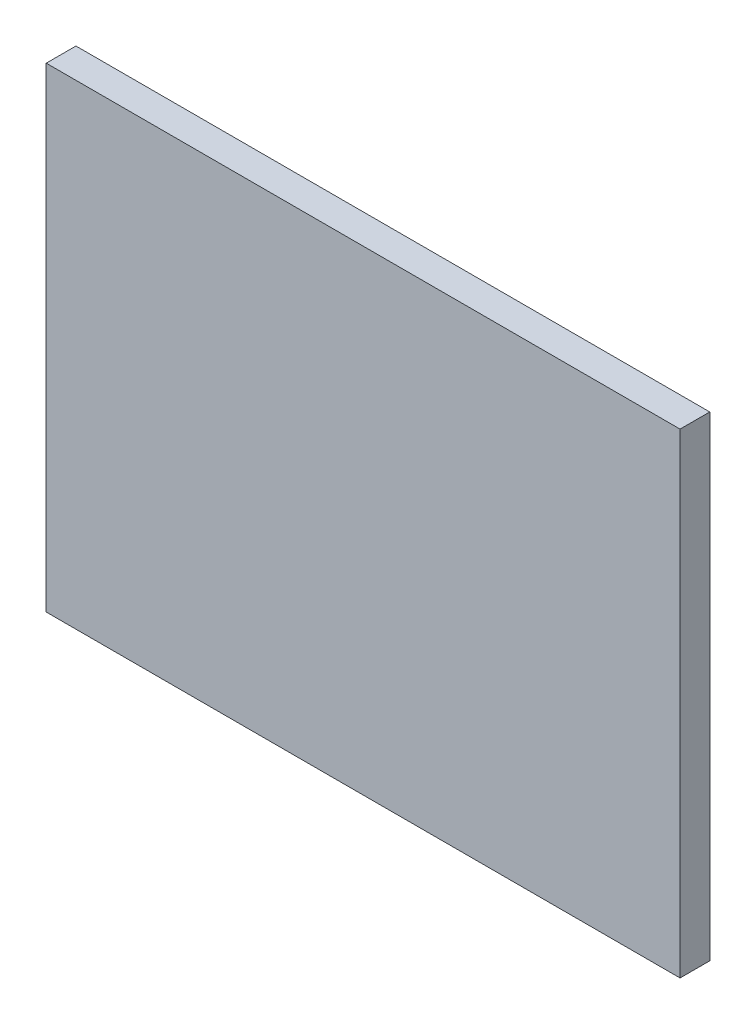
ISO-10303-21;
HEADER;
FILE_DESCRIPTION(('STEP AP214'),'2;1');
FILE_NAME('part.step','',(''),(''),'','','');
FILE_SCHEMA(('AUTOMOTIVE_DESIGN { 1 0 10303 214 1 1 1 1 }'));
ENDSEC;
DATA;
#1=APPLICATION_CONTEXT('core data for automotive mechanical design processes');
#2=APPLICATION_PROTOCOL_DEFINITION('international standard','automotive_design',2000,#1);
#3=PRODUCT_CONTEXT('',#1,'mechanical');
#4=PRODUCT('Part','Part','',(#3));
#5=PRODUCT_RELATED_PRODUCT_CATEGORY('part','',(#4));
#6=PRODUCT_DEFINITION_FORMATION('','',#4);
#7=PRODUCT_DEFINITION_CONTEXT('part definition',#1,'design');
#8=PRODUCT_DEFINITION('design','',#6,#7);
#9=PRODUCT_DEFINITION_SHAPE('','',#8);
#10=(LENGTH_UNIT() NAMED_UNIT(*) SI_UNIT(.MILLI.,.METRE.));
#11=(NAMED_UNIT(*) PLANE_ANGLE_UNIT() SI_UNIT($,.RADIAN.));
#12=(NAMED_UNIT(*) SI_UNIT($,.STERADIAN.) SOLID_ANGLE_UNIT());
#13=UNCERTAINTY_MEASURE_WITH_UNIT(LENGTH_MEASURE(1.E-05),#10,'distance_accuracy_value','');
#14=(GEOMETRIC_REPRESENTATION_CONTEXT(3) GLOBAL_UNCERTAINTY_ASSIGNED_CONTEXT((#13)) GLOBAL_UNIT_ASSIGNED_CONTEXT((#10,
#11,#12)) REPRESENTATION_CONTEXT('',''));
#15=CARTESIAN_POINT('',(0.,0.,0.));
#16=DIRECTION('',(0.,0.,1.));
#17=DIRECTION('',(1.,0.,0.));
#18=AXIS2_PLACEMENT_3D('',#15,#16,#17);
#19=CARTESIAN_POINT('',(-100.400410677618,-228.208829568789,19.05));
#20=DIRECTION('',(1.,0.,0.));
#21=DIRECTION('',(0.,0.,-1.));
#22=AXIS2_PLACEMENT_3D('',#19,#20,#21);
#23=PLANE('',#22);
#24=DIRECTION('',(0.,-1.,0.));
#25=VECTOR('',#24,1.);
#26=CARTESIAN_POINT('',(-100.400410677618,-228.208829568789,0.));
#27=LINE('',#26,#25);
#28=CARTESIAN_POINT('',(-100.400410677618,76.5911704312115,0.));
#29=VERTEX_POINT('',#28);
#30=CARTESIAN_POINT('',(-100.400410677618,-228.208829568789,0.));
#31=VERTEX_POINT('',#30);
#32=EDGE_CURVE('E96',#29,#31,#27,.T.);
#33=ORIENTED_EDGE('',*,*,#32,.T.);
#34=DIRECTION('',(0.,0.,-1.));
#35=VECTOR('',#34,1.);
#36=CARTESIAN_POINT('',(-100.400410677618,-228.208829568789,19.05));
#37=LINE('',#36,#35);
#38=CARTESIAN_POINT('',(-100.400410677618,-228.208829568789,19.05));
#39=VERTEX_POINT('',#38);
#40=EDGE_CURVE('E11',#39,#31,#37,.T.);
#41=ORIENTED_EDGE('',*,*,#40,.F.);
#42=DIRECTION('',(0.,-1.,0.));
#43=VECTOR('',#42,1.);
#44=CARTESIAN_POINT('',(-100.400410677618,-228.208829568789,19.05));
#45=LINE('',#44,#43);
#46=CARTESIAN_POINT('',(-100.400410677618,76.5911704312115,19.05));
#47=VERTEX_POINT('',#46);
#48=EDGE_CURVE('E84',#47,#39,#45,.T.);
#49=ORIENTED_EDGE('',*,*,#48,.F.);
#50=DIRECTION('',(0.,0.,-1.));
#51=VECTOR('',#50,1.);
#52=CARTESIAN_POINT('',(-100.400410677618,76.5911704312115,19.05));
#53=LINE('',#52,#51);
#54=EDGE_CURVE('E92',#47,#29,#53,.T.);
#55=ORIENTED_EDGE('',*,*,#54,.T.);
#56=EDGE_LOOP('',(#33,#41,#49,#55));
#57=FACE_BOUND('',#56,.T.);
#58=ADVANCED_FACE('F33',(#57),#23,.F.);
#59=CARTESIAN_POINT('',(-100.400410677618,-228.208829568789,19.05));
#60=DIRECTION('',(0.,1.,0.));
#61=DIRECTION('',(0.,0.,1.));
#62=AXIS2_PLACEMENT_3D('',#59,#60,#61);
#63=PLANE('',#62);
#64=DIRECTION('',(1.,0.,0.));
#65=VECTOR('',#64,1.);
#66=CARTESIAN_POINT('',(-100.400410677618,-228.208829568789,0.));
#67=LINE('',#66,#65);
#68=CARTESIAN_POINT('',(305.999589322382,-228.208829568789,0.));
#69=VERTEX_POINT('',#68);
#70=EDGE_CURVE('E88',#31,#69,#67,.T.);
#71=ORIENTED_EDGE('',*,*,#70,.T.);
#72=DIRECTION('',(0.,0.,-1.));
#73=VECTOR('',#72,1.);
#74=CARTESIAN_POINT('',(305.999589322382,-228.208829568789,19.05));
#75=LINE('',#74,#73);
#76=CARTESIAN_POINT('',(305.999589322382,-228.208829568789,19.05));
#77=VERTEX_POINT('',#76);
#78=EDGE_CURVE('E41',#77,#69,#75,.T.);
#79=ORIENTED_EDGE('',*,*,#78,.F.);
#80=DIRECTION('',(1.,0.,0.));
#81=VECTOR('',#80,1.);
#82=CARTESIAN_POINT('',(-100.400410677618,-228.208829568789,19.05));
#83=LINE('',#82,#81);
#84=EDGE_CURVE('E79',#39,#77,#83,.T.);
#85=ORIENTED_EDGE('',*,*,#84,.F.);
#86=ORIENTED_EDGE('',*,*,#40,.T.);
#87=EDGE_LOOP('',(#71,#79,#85,#86));
#88=FACE_BOUND('',#87,.T.);
#89=ADVANCED_FACE('F87',(#88),#63,.F.);
#90=CARTESIAN_POINT('',(305.999589322382,-228.208829568789,19.05));
#91=DIRECTION('',(-1.,0.,0.));
#92=DIRECTION('',(0.,0.,1.));
#93=AXIS2_PLACEMENT_3D('',#90,#91,#92);
#94=PLANE('',#93);
#95=DIRECTION('',(0.,1.,0.));
#96=VECTOR('',#95,1.);
#97=CARTESIAN_POINT('',(305.999589322382,-228.208829568789,0.));
#98=LINE('',#97,#96);
#99=CARTESIAN_POINT('',(305.999589322382,76.5911704312115,0.));
#100=VERTEX_POINT('',#99);
#101=EDGE_CURVE('E66',#69,#100,#98,.T.);
#102=ORIENTED_EDGE('',*,*,#101,.T.);
#103=DIRECTION('',(0.,0.,-1.));
#104=VECTOR('',#103,1.);
#105=CARTESIAN_POINT('',(305.999589322382,76.5911704312115,19.05));
#106=LINE('',#105,#104);
#107=CARTESIAN_POINT('',(305.999589322382,76.5911704312115,19.05));
#108=VERTEX_POINT('',#107);
#109=EDGE_CURVE('E89',#108,#100,#106,.T.);
#110=ORIENTED_EDGE('',*,*,#109,.F.);
#111=DIRECTION('',(0.,1.,0.));
#112=VECTOR('',#111,1.);
#113=CARTESIAN_POINT('',(305.999589322382,-228.208829568789,19.05));
#114=LINE('',#113,#112);
#115=EDGE_CURVE('E82',#77,#108,#114,.T.);
#116=ORIENTED_EDGE('',*,*,#115,.F.);
#117=ORIENTED_EDGE('',*,*,#78,.T.);
#118=EDGE_LOOP('',(#102,#110,#116,#117));
#119=FACE_BOUND('',#118,.T.);
#120=ADVANCED_FACE('F90',(#119),#94,.F.);
#121=CARTESIAN_POINT('',(-100.400410677618,76.5911704312115,19.05));
#122=DIRECTION('',(0.,-1.,0.));
#123=DIRECTION('',(0.,0.,-1.));
#124=AXIS2_PLACEMENT_3D('',#121,#122,#123);
#125=PLANE('',#124);
#126=DIRECTION('',(-1.,0.,0.));
#127=VECTOR('',#126,1.);
#128=CARTESIAN_POINT('',(-100.400410677618,76.5911704312115,0.));
#129=LINE('',#128,#127);
#130=EDGE_CURVE('E72',#100,#29,#129,.T.);
#131=ORIENTED_EDGE('',*,*,#130,.T.);
#132=ORIENTED_EDGE('',*,*,#54,.F.);
#133=DIRECTION('',(-1.,0.,0.));
#134=VECTOR('',#133,1.);
#135=CARTESIAN_POINT('',(-100.400410677618,76.5911704312115,19.05));
#136=LINE('',#135,#134);
#137=EDGE_CURVE('E49',#108,#47,#136,.T.);
#138=ORIENTED_EDGE('',*,*,#137,.F.);
#139=ORIENTED_EDGE('',*,*,#109,.T.);
#140=EDGE_LOOP('',(#131,#132,#138,#139));
#141=FACE_BOUND('',#140,.T.);
#142=ADVANCED_FACE('F103',(#141),#125,.F.);
#143=CARTESIAN_POINT('',(-100.400410677618,76.5911704312115,19.05));
#144=DIRECTION('',(0.,0.,-1.));
#145=DIRECTION('',(-1.,0.,0.));
#146=AXIS2_PLACEMENT_3D('',#143,#144,#145);
#147=PLANE('',#146);
#148=ORIENTED_EDGE('',*,*,#48,.T.);
#149=ORIENTED_EDGE('',*,*,#84,.T.);
#150=ORIENTED_EDGE('',*,*,#115,.T.);
#151=ORIENTED_EDGE('',*,*,#137,.T.);
#152=EDGE_LOOP('',(#148,#149,#150,#151));
#153=FACE_BOUND('',#152,.T.);
#154=ADVANCED_FACE('F80',(#153),#147,.F.);
#155=CARTESIAN_POINT('',(-100.400410677618,76.5911704312115,0.));
#156=DIRECTION('',(0.,0.,-1.));
#157=DIRECTION('',(-1.,0.,0.));
#158=AXIS2_PLACEMENT_3D('',#155,#156,#157);
#159=PLANE('',#158);
#160=ORIENTED_EDGE('',*,*,#32,.F.);
#161=ORIENTED_EDGE('',*,*,#130,.F.);
#162=ORIENTED_EDGE('',*,*,#101,.F.);
#163=ORIENTED_EDGE('',*,*,#70,.F.);
#164=EDGE_LOOP('',(#160,#161,#162,#163));
#165=FACE_BOUND('',#164,.T.);
#166=ADVANCED_FACE('F106',(#165),#159,.T.);
#167=CLOSED_SHELL('',(#58,#89,#120,#142,#154,#166));
#168=MANIFOLD_SOLID_BREP('B2',#167);
#169=ADVANCED_BREP_SHAPE_REPRESENTATION('',(#18,#168),#14);
#170=SHAPE_DEFINITION_REPRESENTATION(#9,#169);
ENDSEC;
END-ISO-10303-21;
